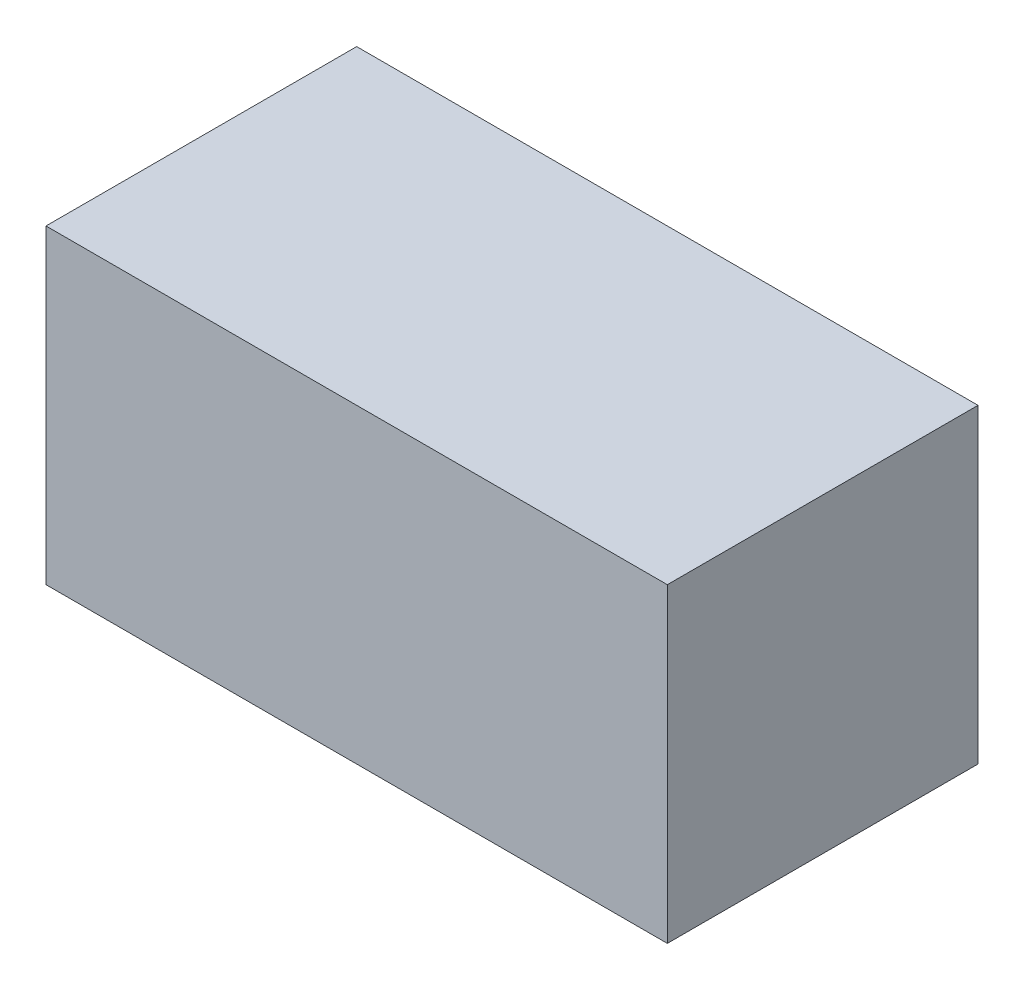
ISO-10303-21;
HEADER;
FILE_DESCRIPTION(('STEP AP214'),'2;1');
FILE_NAME('part.step','',(''),(''),'','','');
FILE_SCHEMA(('AUTOMOTIVE_DESIGN { 1 0 10303 214 1 1 1 1 }'));
ENDSEC;
DATA;
#1=APPLICATION_CONTEXT('core data for automotive mechanical design processes');
#2=APPLICATION_PROTOCOL_DEFINITION('international standard','automotive_design',2000,#1);
#3=PRODUCT_CONTEXT('',#1,'mechanical');
#4=PRODUCT('Part','Part','',(#3));
#5=PRODUCT_RELATED_PRODUCT_CATEGORY('part','',(#4));
#6=PRODUCT_DEFINITION_FORMATION('','',#4);
#7=PRODUCT_DEFINITION_CONTEXT('part definition',#1,'design');
#8=PRODUCT_DEFINITION('design','',#6,#7);
#9=PRODUCT_DEFINITION_SHAPE('','',#8);
#10=(LENGTH_UNIT() NAMED_UNIT(*) SI_UNIT(.MILLI.,.METRE.));
#11=(NAMED_UNIT(*) PLANE_ANGLE_UNIT() SI_UNIT($,.RADIAN.));
#12=(NAMED_UNIT(*) SI_UNIT($,.STERADIAN.) SOLID_ANGLE_UNIT());
#13=UNCERTAINTY_MEASURE_WITH_UNIT(LENGTH_MEASURE(1.E-05),#10,'distance_accuracy_value','');
#14=(GEOMETRIC_REPRESENTATION_CONTEXT(3) GLOBAL_UNCERTAINTY_ASSIGNED_CONTEXT((#13)) GLOBAL_UNIT_ASSIGNED_CONTEXT((#10,
#11,#12)) REPRESENTATION_CONTEXT('',''));
#15=CARTESIAN_POINT('',(0.,0.,0.));
#16=DIRECTION('',(0.,0.,1.));
#17=DIRECTION('',(1.,0.,0.));
#18=AXIS2_PLACEMENT_3D('',#15,#16,#17);
#19=CARTESIAN_POINT('',(-10.0000000000001,10.,-5.00000000000005));
#20=DIRECTION('',(1.,0.,0.));
#21=DIRECTION('',(0.,0.,-1.));
#22=AXIS2_PLACEMENT_3D('',#19,#20,#21);
#23=PLANE('',#22);
#24=DIRECTION('',(0.,0.,1.));
#25=VECTOR('',#24,1.);
#26=CARTESIAN_POINT('',(-10.0000000000001,0.,-5.00000000000005));
#27=LINE('',#26,#25);
#28=CARTESIAN_POINT('',(-10.0000000000001,0.,-5.00000000000005));
#29=VERTEX_POINT('',#28);
#30=CARTESIAN_POINT('',(-10.0000000000001,0.,4.99999999999995));
#31=VERTEX_POINT('',#30);
#32=EDGE_CURVE('E96',#29,#31,#27,.T.);
#33=ORIENTED_EDGE('',*,*,#32,.T.);
#34=DIRECTION('',(0.,-1.,0.));
#35=VECTOR('',#34,1.);
#36=CARTESIAN_POINT('',(-10.0000000000001,10.,4.99999999999995));
#37=LINE('',#36,#35);
#38=CARTESIAN_POINT('',(-10.0000000000001,10.,4.99999999999995));
#39=VERTEX_POINT('',#38);
#40=EDGE_CURVE('E11',#39,#31,#37,.T.);
#41=ORIENTED_EDGE('',*,*,#40,.F.);
#42=DIRECTION('',(0.,0.,1.));
#43=VECTOR('',#42,1.);
#44=CARTESIAN_POINT('',(-10.0000000000001,10.,-5.00000000000005));
#45=LINE('',#44,#43);
#46=CARTESIAN_POINT('',(-10.0000000000001,10.,-5.00000000000005));
#47=VERTEX_POINT('',#46);
#48=EDGE_CURVE('E84',#47,#39,#45,.T.);
#49=ORIENTED_EDGE('',*,*,#48,.F.);
#50=DIRECTION('',(0.,-1.,0.));
#51=VECTOR('',#50,1.);
#52=CARTESIAN_POINT('',(-10.0000000000001,10.,-5.00000000000005));
#53=LINE('',#52,#51);
#54=EDGE_CURVE('E92',#47,#29,#53,.T.);
#55=ORIENTED_EDGE('',*,*,#54,.T.);
#56=EDGE_LOOP('',(#33,#41,#49,#55));
#57=FACE_BOUND('',#56,.T.);
#58=ADVANCED_FACE('F33',(#57),#23,.F.);
#59=CARTESIAN_POINT('',(-10.0000000000001,10.,4.99999999999995));
#60=DIRECTION('',(0.,0.,-1.));
#61=DIRECTION('',(-1.,0.,0.));
#62=AXIS2_PLACEMENT_3D('',#59,#60,#61);
#63=PLANE('',#62);
#64=DIRECTION('',(1.,0.,0.));
#65=VECTOR('',#64,1.);
#66=CARTESIAN_POINT('',(-10.0000000000001,0.,4.99999999999995));
#67=LINE('',#66,#65);
#68=CARTESIAN_POINT('',(9.99999999999995,0.,4.99999999999995));
#69=VERTEX_POINT('',#68);
#70=EDGE_CURVE('E88',#31,#69,#67,.T.);
#71=ORIENTED_EDGE('',*,*,#70,.T.);
#72=DIRECTION('',(0.,-1.,0.));
#73=VECTOR('',#72,1.);
#74=CARTESIAN_POINT('',(9.99999999999995,10.,4.99999999999995));
#75=LINE('',#74,#73);
#76=CARTESIAN_POINT('',(9.99999999999995,10.,4.99999999999995));
#77=VERTEX_POINT('',#76);
#78=EDGE_CURVE('E41',#77,#69,#75,.T.);
#79=ORIENTED_EDGE('',*,*,#78,.F.);
#80=DIRECTION('',(1.,0.,0.));
#81=VECTOR('',#80,1.);
#82=CARTESIAN_POINT('',(-10.0000000000001,10.,4.99999999999995));
#83=LINE('',#82,#81);
#84=EDGE_CURVE('E79',#39,#77,#83,.T.);
#85=ORIENTED_EDGE('',*,*,#84,.F.);
#86=ORIENTED_EDGE('',*,*,#40,.T.);
#87=EDGE_LOOP('',(#71,#79,#85,#86));
#88=FACE_BOUND('',#87,.T.);
#89=ADVANCED_FACE('F87',(#88),#63,.F.);
#90=CARTESIAN_POINT('',(9.99999999999995,10.,-5.00000000000005));
#91=DIRECTION('',(-1.,0.,0.));
#92=DIRECTION('',(0.,0.,1.));
#93=AXIS2_PLACEMENT_3D('',#90,#91,#92);
#94=PLANE('',#93);
#95=DIRECTION('',(0.,0.,-1.));
#96=VECTOR('',#95,1.);
#97=CARTESIAN_POINT('',(9.99999999999995,0.,-5.00000000000005));
#98=LINE('',#97,#96);
#99=CARTESIAN_POINT('',(9.99999999999995,0.,-5.00000000000005));
#100=VERTEX_POINT('',#99);
#101=EDGE_CURVE('E66',#69,#100,#98,.T.);
#102=ORIENTED_EDGE('',*,*,#101,.T.);
#103=DIRECTION('',(0.,-1.,0.));
#104=VECTOR('',#103,1.);
#105=CARTESIAN_POINT('',(9.99999999999995,10.,-5.00000000000005));
#106=LINE('',#105,#104);
#107=CARTESIAN_POINT('',(9.99999999999995,10.,-5.00000000000005));
#108=VERTEX_POINT('',#107);
#109=EDGE_CURVE('E89',#108,#100,#106,.T.);
#110=ORIENTED_EDGE('',*,*,#109,.F.);
#111=DIRECTION('',(0.,0.,-1.));
#112=VECTOR('',#111,1.);
#113=CARTESIAN_POINT('',(9.99999999999995,10.,-5.00000000000005));
#114=LINE('',#113,#112);
#115=EDGE_CURVE('E82',#77,#108,#114,.T.);
#116=ORIENTED_EDGE('',*,*,#115,.F.);
#117=ORIENTED_EDGE('',*,*,#78,.T.);
#118=EDGE_LOOP('',(#102,#110,#116,#117));
#119=FACE_BOUND('',#118,.T.);
#120=ADVANCED_FACE('F90',(#119),#94,.F.);
#121=CARTESIAN_POINT('',(-10.0000000000001,10.,-5.00000000000005));
#122=DIRECTION('',(0.,0.,1.));
#123=DIRECTION('',(1.,0.,0.));
#124=AXIS2_PLACEMENT_3D('',#121,#122,#123);
#125=PLANE('',#124);
#126=DIRECTION('',(-1.,0.,0.));
#127=VECTOR('',#126,1.);
#128=CARTESIAN_POINT('',(-10.0000000000001,0.,-5.00000000000005));
#129=LINE('',#128,#127);
#130=EDGE_CURVE('E72',#100,#29,#129,.T.);
#131=ORIENTED_EDGE('',*,*,#130,.T.);
#132=ORIENTED_EDGE('',*,*,#54,.F.);
#133=DIRECTION('',(-1.,0.,0.));
#134=VECTOR('',#133,1.);
#135=CARTESIAN_POINT('',(-10.0000000000001,10.,-5.00000000000005));
#136=LINE('',#135,#134);
#137=EDGE_CURVE('E49',#108,#47,#136,.T.);
#138=ORIENTED_EDGE('',*,*,#137,.F.);
#139=ORIENTED_EDGE('',*,*,#109,.T.);
#140=EDGE_LOOP('',(#131,#132,#138,#139));
#141=FACE_BOUND('',#140,.T.);
#142=ADVANCED_FACE('F103',(#141),#125,.F.);
#143=CARTESIAN_POINT('',(0.,10.,0.));
#144=DIRECTION('',(0.,1.,0.));
#145=DIRECTION('',(0.,0.,1.));
#146=AXIS2_PLACEMENT_3D('',#143,#144,#145);
#147=PLANE('',#146);
#148=ORIENTED_EDGE('',*,*,#48,.T.);
#149=ORIENTED_EDGE('',*,*,#84,.T.);
#150=ORIENTED_EDGE('',*,*,#115,.T.);
#151=ORIENTED_EDGE('',*,*,#137,.T.);
#152=EDGE_LOOP('',(#148,#149,#150,#151));
#153=FACE_BOUND('',#152,.T.);
#154=ADVANCED_FACE('F80',(#153),#147,.T.);
#155=CARTESIAN_POINT('',(0.,0.,0.));
#156=DIRECTION('',(0.,1.,0.));
#157=DIRECTION('',(0.,0.,1.));
#158=AXIS2_PLACEMENT_3D('',#155,#156,#157);
#159=PLANE('',#158);
#160=ORIENTED_EDGE('',*,*,#32,.F.);
#161=ORIENTED_EDGE('',*,*,#130,.F.);
#162=ORIENTED_EDGE('',*,*,#101,.F.);
#163=ORIENTED_EDGE('',*,*,#70,.F.);
#164=EDGE_LOOP('',(#160,#161,#162,#163));
#165=FACE_BOUND('',#164,.T.);
#166=ADVANCED_FACE('F106',(#165),#159,.F.);
#167=CLOSED_SHELL('',(#58,#89,#120,#142,#154,#166));
#168=MANIFOLD_SOLID_BREP('B2',#167);
#169=ADVANCED_BREP_SHAPE_REPRESENTATION('',(#18,#168),#14);
#170=SHAPE_DEFINITION_REPRESENTATION(#9,#169);
ENDSEC;
END-ISO-10303-21;
